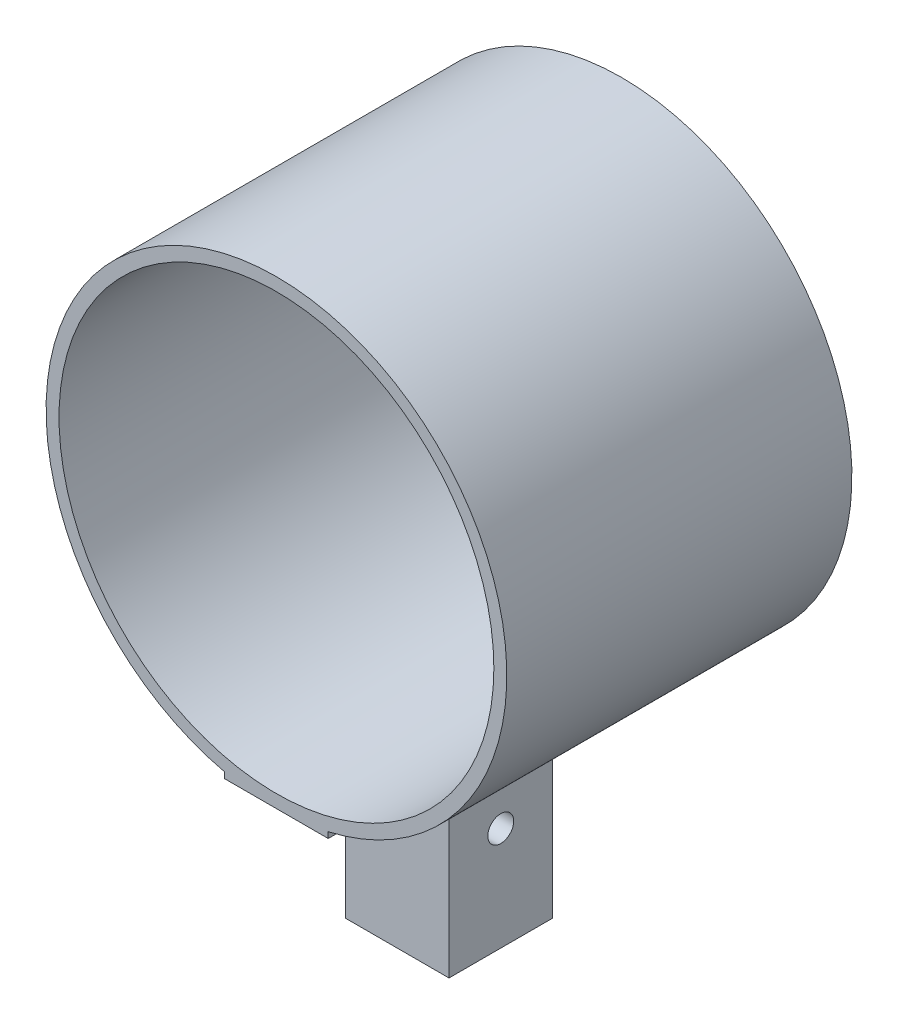
ISO-10303-21;
HEADER;
FILE_DESCRIPTION(('STEP AP214'),'2;1');
FILE_NAME('part.step','',(''),(''),'','','');
FILE_SCHEMA(('AUTOMOTIVE_DESIGN { 1 0 10303 214 1 1 1 1 }'));
ENDSEC;
DATA;
#1=APPLICATION_CONTEXT('core data for automotive mechanical design processes');
#2=APPLICATION_PROTOCOL_DEFINITION('international standard','automotive_design',2000,#1);
#3=PRODUCT_CONTEXT('',#1,'mechanical');
#4=PRODUCT('Part','Part','',(#3));
#5=PRODUCT_RELATED_PRODUCT_CATEGORY('part','',(#4));
#6=PRODUCT_DEFINITION_FORMATION('','',#4);
#7=PRODUCT_DEFINITION_CONTEXT('part definition',#1,'design');
#8=PRODUCT_DEFINITION('design','',#6,#7);
#9=PRODUCT_DEFINITION_SHAPE('','',#8);
#10=(LENGTH_UNIT() NAMED_UNIT(*) SI_UNIT(.MILLI.,.METRE.));
#11=(NAMED_UNIT(*) PLANE_ANGLE_UNIT() SI_UNIT($,.RADIAN.));
#12=(NAMED_UNIT(*) SI_UNIT($,.STERADIAN.) SOLID_ANGLE_UNIT());
#13=UNCERTAINTY_MEASURE_WITH_UNIT(LENGTH_MEASURE(1.E-05),#10,'distance_accuracy_value','');
#14=(GEOMETRIC_REPRESENTATION_CONTEXT(3) GLOBAL_UNCERTAINTY_ASSIGNED_CONTEXT((#13)) GLOBAL_UNIT_ASSIGNED_CONTEXT((#10,
#11,#12)) REPRESENTATION_CONTEXT('',''));
#15=CARTESIAN_POINT('',(0.,0.,0.));
#16=DIRECTION('',(0.,0.,1.));
#17=DIRECTION('',(1.,0.,0.));
#18=AXIS2_PLACEMENT_3D('',#15,#16,#17);
#19=CARTESIAN_POINT('',(-12.7,-56.515,84.6666666666667));
#20=DIRECTION('',(0.,1.,0.));
#21=DIRECTION('',(0.,0.,1.));
#22=AXIS2_PLACEMENT_3D('',#19,#20,#21);
#23=PLANE('',#22);
#24=DIRECTION('',(1.,0.,0.));
#25=VECTOR('',#24,1.);
#26=CARTESIAN_POINT('',(-12.7,-56.515,29.6333333333334));
#27=LINE('',#26,#25);
#28=CARTESIAN_POINT('',(-12.7,-56.515,29.6333333333334));
#29=VERTEX_POINT('',#28);
#30=CARTESIAN_POINT('',(12.7,-56.515,29.6333333333334));
#31=VERTEX_POINT('',#30);
#32=EDGE_CURVE('E55',#29,#31,#27,.T.);
#33=ORIENTED_EDGE('',*,*,#32,.F.);
#34=DIRECTION('',(0.,0.,-1.));
#35=VECTOR('',#34,1.);
#36=CARTESIAN_POINT('',(-12.7,-56.515,84.6666666666667));
#37=LINE('',#36,#35);
#38=CARTESIAN_POINT('',(-12.7,-56.515,0.));
#39=VERTEX_POINT('',#38);
#40=EDGE_CURVE('E178',#29,#39,#37,.T.);
#41=ORIENTED_EDGE('',*,*,#40,.T.);
#42=DIRECTION('',(1.,0.,0.));
#43=VECTOR('',#42,1.);
#44=CARTESIAN_POINT('',(-12.7,-56.515,0.));
#45=LINE('',#44,#43);
#46=CARTESIAN_POINT('',(12.7,-56.515,0.));
#47=VERTEX_POINT('',#46);
#48=EDGE_CURVE('E169',#39,#47,#45,.T.);
#49=ORIENTED_EDGE('',*,*,#48,.T.);
#50=DIRECTION('',(0.,0.,-1.));
#51=VECTOR('',#50,1.);
#52=CARTESIAN_POINT('',(12.7,-56.515,84.6666666666667));
#53=LINE('',#52,#51);
#54=EDGE_CURVE('E60',#31,#47,#53,.T.);
#55=ORIENTED_EDGE('',*,*,#54,.F.);
#56=EDGE_LOOP('',(#33,#41,#49,#55));
#57=FACE_BOUND('',#56,.T.);
#58=ADVANCED_FACE('F39',(#57),#23,.F.);
#59=DIRECTION('',(-1.,0.,0.));
#60=VECTOR('',#59,1.);
#61=CARTESIAN_POINT('',(-12.7,-56.515,55.0333333333333));
#62=LINE('',#61,#60);
#63=CARTESIAN_POINT('',(12.7,-56.515,55.0333333333333));
#64=VERTEX_POINT('',#63);
#65=CARTESIAN_POINT('',(-12.7,-56.515,55.0333333333333));
#66=VERTEX_POINT('',#65);
#67=EDGE_CURVE('E200',#64,#66,#62,.T.);
#68=ORIENTED_EDGE('',*,*,#67,.F.);
#69=CARTESIAN_POINT('',(12.7,-56.515,84.6666666666667));
#70=VERTEX_POINT('',#69);
#71=EDGE_CURVE('E130',#70,#64,#53,.T.);
#72=ORIENTED_EDGE('',*,*,#71,.F.);
#73=DIRECTION('',(1.,0.,0.));
#74=VECTOR('',#73,1.);
#75=CARTESIAN_POINT('',(-12.7,-56.515,84.6666666666667));
#76=LINE('',#75,#74);
#77=CARTESIAN_POINT('',(-12.7,-56.515,84.6666666666667));
#78=VERTEX_POINT('',#77);
#79=EDGE_CURVE('E155',#78,#70,#76,.T.);
#80=ORIENTED_EDGE('',*,*,#79,.F.);
#81=EDGE_CURVE('E48',#78,#66,#37,.T.);
#82=ORIENTED_EDGE('',*,*,#81,.T.);
#83=EDGE_LOOP('',(#68,#72,#80,#82));
#84=FACE_BOUND('',#83,.T.);
#85=ADVANCED_FACE('F199',(#84),#23,.F.);
#86=CARTESIAN_POINT('',(0.,0.,84.6666666666667));
#87=DIRECTION('',(0.,0.,-1.));
#88=DIRECTION('',(-1.,0.,0.));
#89=AXIS2_PLACEMENT_3D('',#86,#87,#88);
#90=CYLINDRICAL_SURFACE('',#89,56.515);
#91=CARTESIAN_POINT('',(0.,0.,0.));
#92=DIRECTION('',(0.,0.,1.));
#93=DIRECTION('',(1.,0.,0.));
#94=AXIS2_PLACEMENT_3D('',#91,#92,#93);
#95=CIRCLE('',#94,56.515);
#96=CARTESIAN_POINT('',(12.7,-55.0695489812655,0.));
#97=VERTEX_POINT('',#96);
#98=CARTESIAN_POINT('',(-12.7,-55.0695489812655,0.));
#99=VERTEX_POINT('',#98);
#100=EDGE_CURVE('E145',#97,#99,#95,.T.);
#101=ORIENTED_EDGE('',*,*,#100,.T.);
#102=DIRECTION('',(0.,0.,-1.));
#103=VECTOR('',#102,1.);
#104=CARTESIAN_POINT('',(-12.7,-55.0695489812655,84.6666666666667));
#105=LINE('',#104,#103);
#106=CARTESIAN_POINT('',(-12.7,-55.0695489812655,84.6666666666667));
#107=VERTEX_POINT('',#106);
#108=EDGE_CURVE('E11',#107,#99,#105,.T.);
#109=ORIENTED_EDGE('',*,*,#108,.F.);
#110=CARTESIAN_POINT('',(0.,0.,84.6666666666667));
#111=DIRECTION('',(0.,0.,1.));
#112=DIRECTION('',(1.,0.,0.));
#113=AXIS2_PLACEMENT_3D('',#110,#111,#112);
#114=CIRCLE('',#113,56.515);
#115=CARTESIAN_POINT('',(12.7,-55.0695489812655,84.6666666666667));
#116=VERTEX_POINT('',#115);
#117=EDGE_CURVE('E147',#116,#107,#114,.T.);
#118=ORIENTED_EDGE('',*,*,#117,.F.);
#119=DIRECTION('',(0.,0.,-1.));
#120=VECTOR('',#119,1.);
#121=CARTESIAN_POINT('',(12.7,-55.0695489812655,84.6666666666667));
#122=LINE('',#121,#120);
#123=EDGE_CURVE('E161',#116,#97,#122,.T.);
#124=ORIENTED_EDGE('',*,*,#123,.T.);
#125=EDGE_LOOP('',(#101,#109,#118,#124));
#126=FACE_BOUND('',#125,.T.);
#127=ADVANCED_FACE('F41',(#126),#90,.T.);
#128=CARTESIAN_POINT('',(-12.7,-56.515,84.6666666666667));
#129=DIRECTION('',(1.,0.,0.));
#130=DIRECTION('',(0.,0.,-1.));
#131=AXIS2_PLACEMENT_3D('',#128,#129,#130);
#132=PLANE('',#131);
#133=CARTESIAN_POINT('',(-12.7,-75.565,42.3333333333333));
#134=DIRECTION('',(1.,0.,0.));
#135=DIRECTION('',(0.,0.,-1.));
#136=AXIS2_PLACEMENT_3D('',#133,#134,#135);
#137=CIRCLE('',#136,3.17500000000011);
#138=CARTESIAN_POINT('',(-12.7,-75.565,39.1583333333332));
#139=VERTEX_POINT('',#138);
#140=EDGE_CURVE('E202',#139,#139,#137,.T.);
#141=ORIENTED_EDGE('',*,*,#140,.T.);
#142=EDGE_LOOP('',(#141));
#143=FACE_BOUND('',#142,.T.);
#144=DIRECTION('',(0.,-1.,0.));
#145=VECTOR('',#144,1.);
#146=CARTESIAN_POINT('',(-12.7,-56.515,0.));
#147=LINE('',#146,#145);
#148=EDGE_CURVE('E165',#99,#39,#147,.T.);
#149=ORIENTED_EDGE('',*,*,#148,.T.);
#150=ORIENTED_EDGE('',*,*,#40,.F.);
#151=DIRECTION('',(0.,1.,0.));
#152=VECTOR('',#151,1.);
#153=CARTESIAN_POINT('',(-12.7,-100.965,29.6333333333334));
#154=LINE('',#153,#152);
#155=CARTESIAN_POINT('',(-12.7,-100.965,29.6333333333334));
#156=VERTEX_POINT('',#155);
#157=EDGE_CURVE('E139',#156,#29,#154,.T.);
#158=ORIENTED_EDGE('',*,*,#157,.F.);
#159=DIRECTION('',(0.,0.,-1.));
#160=VECTOR('',#159,1.);
#161=CARTESIAN_POINT('',(-12.7,-100.965,29.6333333333334));
#162=LINE('',#161,#160);
#163=CARTESIAN_POINT('',(-12.7,-100.965,55.0333333333333));
#164=VERTEX_POINT('',#163);
#165=EDGE_CURVE('E114',#164,#156,#162,.T.);
#166=ORIENTED_EDGE('',*,*,#165,.F.);
#167=DIRECTION('',(0.,1.,0.));
#168=VECTOR('',#167,1.);
#169=CARTESIAN_POINT('',(-12.7,-100.965,55.0333333333333));
#170=LINE('',#169,#168);
#171=EDGE_CURVE('E110',#164,#66,#170,.T.);
#172=ORIENTED_EDGE('',*,*,#171,.T.);
#173=ORIENTED_EDGE('',*,*,#81,.F.);
#174=DIRECTION('',(0.,-1.,0.));
#175=VECTOR('',#174,1.);
#176=CARTESIAN_POINT('',(-12.7,-56.515,84.6666666666667));
#177=LINE('',#176,#175);
#178=EDGE_CURVE('E151',#107,#78,#177,.T.);
#179=ORIENTED_EDGE('',*,*,#178,.F.);
#180=ORIENTED_EDGE('',*,*,#108,.T.);
#181=EDGE_LOOP('',(#149,#150,#158,#166,#172,#173,#179,#180));
#182=FACE_BOUND('',#181,.T.);
#183=ADVANCED_FACE('F189',(#143,#182),#132,.F.);
#184=CARTESIAN_POINT('',(12.7,-56.515,84.6666666666667));
#185=DIRECTION('',(-1.,0.,0.));
#186=DIRECTION('',(0.,0.,1.));
#187=AXIS2_PLACEMENT_3D('',#184,#185,#186);
#188=PLANE('',#187);
#189=CARTESIAN_POINT('',(12.7,-75.565,42.3333333333333));
#190=DIRECTION('',(1.,0.,0.));
#191=DIRECTION('',(0.,0.,-1.));
#192=AXIS2_PLACEMENT_3D('',#189,#190,#191);
#193=CIRCLE('',#192,3.17500000000011);
#194=CARTESIAN_POINT('',(12.7,-75.565,39.1583333333332));
#195=VERTEX_POINT('',#194);
#196=EDGE_CURVE('E208',#195,#195,#193,.T.);
#197=ORIENTED_EDGE('',*,*,#196,.F.);
#198=EDGE_LOOP('',(#197));
#199=FACE_BOUND('',#198,.T.);
#200=DIRECTION('',(0.,1.,0.));
#201=VECTOR('',#200,1.);
#202=CARTESIAN_POINT('',(12.7,-56.515,0.));
#203=LINE('',#202,#201);
#204=EDGE_CURVE('E152',#47,#97,#203,.T.);
#205=ORIENTED_EDGE('',*,*,#204,.T.);
#206=ORIENTED_EDGE('',*,*,#123,.F.);
#207=DIRECTION('',(0.,1.,0.));
#208=VECTOR('',#207,1.);
#209=CARTESIAN_POINT('',(12.7,-56.515,84.6666666666667));
#210=LINE('',#209,#208);
#211=EDGE_CURVE('E158',#70,#116,#210,.T.);
#212=ORIENTED_EDGE('',*,*,#211,.F.);
#213=ORIENTED_EDGE('',*,*,#71,.T.);
#214=DIRECTION('',(0.,1.,0.));
#215=VECTOR('',#214,1.);
#216=CARTESIAN_POINT('',(12.7,-100.965,55.0333333333333));
#217=LINE('',#216,#215);
#218=CARTESIAN_POINT('',(12.7,-100.965,55.0333333333333));
#219=VERTEX_POINT('',#218);
#220=EDGE_CURVE('E108',#219,#64,#217,.T.);
#221=ORIENTED_EDGE('',*,*,#220,.F.);
#222=DIRECTION('',(0.,0.,1.));
#223=VECTOR('',#222,1.);
#224=CARTESIAN_POINT('',(12.7,-100.965,29.6333333333334));
#225=LINE('',#224,#223);
#226=CARTESIAN_POINT('',(12.7,-100.965,29.6333333333334));
#227=VERTEX_POINT('',#226);
#228=EDGE_CURVE('E115',#227,#219,#225,.T.);
#229=ORIENTED_EDGE('',*,*,#228,.F.);
#230=DIRECTION('',(0.,1.,0.));
#231=VECTOR('',#230,1.);
#232=CARTESIAN_POINT('',(12.7,-100.965,29.6333333333334));
#233=LINE('',#232,#231);
#234=EDGE_CURVE('E213',#227,#31,#233,.T.);
#235=ORIENTED_EDGE('',*,*,#234,.T.);
#236=ORIENTED_EDGE('',*,*,#54,.T.);
#237=EDGE_LOOP('',(#205,#206,#212,#213,#221,#229,#235,#236));
#238=FACE_BOUND('',#237,.T.);
#239=ADVANCED_FACE('F127',(#199,#238),#188,.F.);
#240=CARTESIAN_POINT('',(0.,0.,84.6666666666667));
#241=DIRECTION('',(0.,0.,1.));
#242=DIRECTION('',(1.,0.,0.));
#243=AXIS2_PLACEMENT_3D('',#240,#241,#242);
#244=PLANE('',#243);
#245=CARTESIAN_POINT('',(0.,0.,84.6666666666667));
#246=DIRECTION('',(0.,0.,1.));
#247=DIRECTION('',(1.,0.,0.));
#248=AXIS2_PLACEMENT_3D('',#245,#246,#247);
#249=CIRCLE('',#248,53.34);
#250=CARTESIAN_POINT('',(53.34,0.,84.6666666666667));
#251=VERTEX_POINT('',#250);
#252=EDGE_CURVE('E132',#251,#251,#249,.T.);
#253=ORIENTED_EDGE('',*,*,#252,.F.);
#254=EDGE_LOOP('',(#253));
#255=FACE_BOUND('',#254,.T.);
#256=ORIENTED_EDGE('',*,*,#117,.T.);
#257=ORIENTED_EDGE('',*,*,#178,.T.);
#258=ORIENTED_EDGE('',*,*,#79,.T.);
#259=ORIENTED_EDGE('',*,*,#211,.T.);
#260=EDGE_LOOP('',(#256,#257,#258,#259));
#261=FACE_BOUND('',#260,.T.);
#262=ADVANCED_FACE('F198',(#255,#261),#244,.T.);
#263=CARTESIAN_POINT('',(0.,0.,0.));
#264=DIRECTION('',(0.,0.,1.));
#265=DIRECTION('',(1.,0.,0.));
#266=AXIS2_PLACEMENT_3D('',#263,#264,#265);
#267=PLANE('',#266);
#268=CARTESIAN_POINT('',(0.,0.,0.));
#269=DIRECTION('',(0.,0.,1.));
#270=DIRECTION('',(1.,0.,0.));
#271=AXIS2_PLACEMENT_3D('',#268,#269,#270);
#272=CIRCLE('',#271,53.34);
#273=CARTESIAN_POINT('',(53.34,0.,0.));
#274=VERTEX_POINT('',#273);
#275=EDGE_CURVE('E137',#274,#274,#272,.T.);
#276=ORIENTED_EDGE('',*,*,#275,.T.);
#277=EDGE_LOOP('',(#276));
#278=FACE_BOUND('',#277,.T.);
#279=ORIENTED_EDGE('',*,*,#100,.F.);
#280=ORIENTED_EDGE('',*,*,#204,.F.);
#281=ORIENTED_EDGE('',*,*,#48,.F.);
#282=ORIENTED_EDGE('',*,*,#148,.F.);
#283=EDGE_LOOP('',(#279,#280,#281,#282));
#284=FACE_BOUND('',#283,.T.);
#285=ADVANCED_FACE('F193',(#278,#284),#267,.F.);
#286=CARTESIAN_POINT('',(0.,0.,0.));
#287=DIRECTION('',(0.,0.,1.));
#288=DIRECTION('',(1.,0.,0.));
#289=AXIS2_PLACEMENT_3D('',#286,#287,#288);
#290=CYLINDRICAL_SURFACE('',#289,53.34);
#291=ORIENTED_EDGE('',*,*,#275,.F.);
#292=EDGE_LOOP('',(#291));
#293=FACE_BOUND('',#292,.T.);
#294=ORIENTED_EDGE('',*,*,#252,.T.);
#295=EDGE_LOOP('',(#294));
#296=FACE_BOUND('',#295,.T.);
#297=ADVANCED_FACE('F289',(#293,#296),#290,.F.);
#298=CARTESIAN_POINT('',(-12.7,-100.965,55.0333333333333));
#299=DIRECTION('',(0.,0.,-1.));
#300=DIRECTION('',(-1.,0.,0.));
#301=AXIS2_PLACEMENT_3D('',#298,#299,#300);
#302=PLANE('',#301);
#303=ORIENTED_EDGE('',*,*,#67,.T.);
#304=ORIENTED_EDGE('',*,*,#171,.F.);
#305=DIRECTION('',(-1.,0.,0.));
#306=VECTOR('',#305,1.);
#307=CARTESIAN_POINT('',(-12.7,-100.965,55.0333333333333));
#308=LINE('',#307,#306);
#309=EDGE_CURVE('E103',#219,#164,#308,.T.);
#310=ORIENTED_EDGE('',*,*,#309,.F.);
#311=ORIENTED_EDGE('',*,*,#220,.T.);
#312=EDGE_LOOP('',(#303,#304,#310,#311));
#313=FACE_BOUND('',#312,.T.);
#314=ADVANCED_FACE('F106',(#313),#302,.F.);
#315=CARTESIAN_POINT('',(-12.7,-100.965,29.6333333333334));
#316=DIRECTION('',(0.,0.,1.));
#317=DIRECTION('',(1.,0.,0.));
#318=AXIS2_PLACEMENT_3D('',#315,#316,#317);
#319=PLANE('',#318);
#320=ORIENTED_EDGE('',*,*,#32,.T.);
#321=ORIENTED_EDGE('',*,*,#234,.F.);
#322=DIRECTION('',(1.,0.,0.));
#323=VECTOR('',#322,1.);
#324=CARTESIAN_POINT('',(-12.7,-100.965,29.6333333333334));
#325=LINE('',#324,#323);
#326=EDGE_CURVE('E120',#156,#227,#325,.T.);
#327=ORIENTED_EDGE('',*,*,#326,.F.);
#328=ORIENTED_EDGE('',*,*,#157,.T.);
#329=EDGE_LOOP('',(#320,#321,#327,#328));
#330=FACE_BOUND('',#329,.T.);
#331=ADVANCED_FACE('F217',(#330),#319,.F.);
#332=CARTESIAN_POINT('',(0.,-100.965,0.));
#333=DIRECTION('',(0.,1.,0.));
#334=DIRECTION('',(0.,0.,1.));
#335=AXIS2_PLACEMENT_3D('',#332,#333,#334);
#336=PLANE('',#335);
#337=ORIENTED_EDGE('',*,*,#228,.T.);
#338=ORIENTED_EDGE('',*,*,#309,.T.);
#339=ORIENTED_EDGE('',*,*,#165,.T.);
#340=ORIENTED_EDGE('',*,*,#326,.T.);
#341=EDGE_LOOP('',(#337,#338,#339,#340));
#342=FACE_BOUND('',#341,.T.);
#343=ADVANCED_FACE('F118',(#342),#336,.F.);
#344=CARTESIAN_POINT('',(-56.515,-75.565,42.3333333333333));
#345=DIRECTION('',(1.,0.,0.));
#346=DIRECTION('',(0.,0.,-1.));
#347=AXIS2_PLACEMENT_3D('',#344,#345,#346);
#348=CYLINDRICAL_SURFACE('',#347,3.17500000000011);
#349=ORIENTED_EDGE('',*,*,#196,.T.);
#350=EDGE_LOOP('',(#349));
#351=FACE_BOUND('',#350,.T.);
#352=ORIENTED_EDGE('',*,*,#140,.F.);
#353=EDGE_LOOP('',(#352));
#354=FACE_BOUND('',#353,.T.);
#355=ADVANCED_FACE('F225',(#351,#354),#348,.F.);
#356=CLOSED_SHELL('',(#58,#85,#127,#183,#239,#262,#285,#297,#314,#331,#343,#355));
#357=MANIFOLD_SOLID_BREP('B2',#356);
#358=ADVANCED_BREP_SHAPE_REPRESENTATION('',(#18,#357),#14);
#359=SHAPE_DEFINITION_REPRESENTATION(#9,#358);
ENDSEC;
END-ISO-10303-21;
